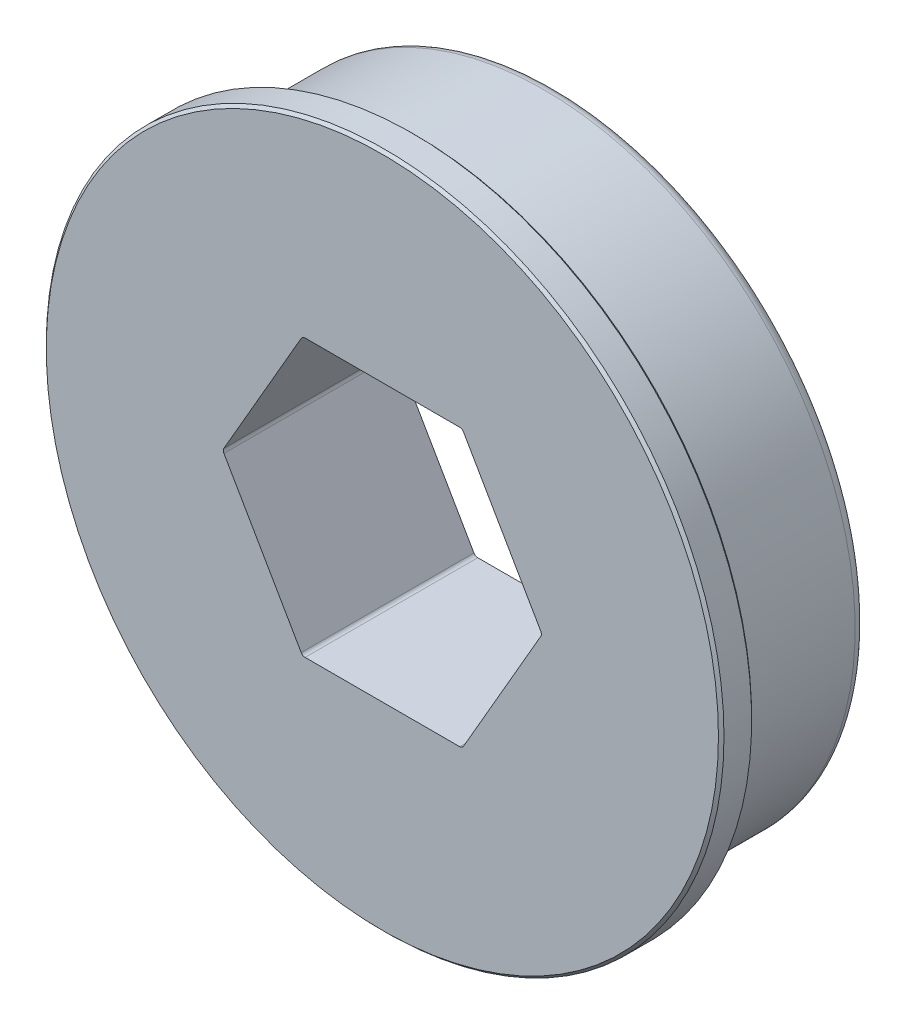
ISO-10303-21;
HEADER;
FILE_DESCRIPTION(('STEP AP214'),'2;1');
FILE_NAME('part.step','',(''),(''),'','','');
FILE_SCHEMA(('AUTOMOTIVE_DESIGN { 1 0 10303 214 1 1 1 1 }'));
ENDSEC;
DATA;
#1=APPLICATION_CONTEXT('core data for automotive mechanical design processes');
#2=APPLICATION_PROTOCOL_DEFINITION('international standard','automotive_design',2000,#1);
#3=PRODUCT_CONTEXT('',#1,'mechanical');
#4=PRODUCT('Part','Part','',(#3));
#5=PRODUCT_RELATED_PRODUCT_CATEGORY('part','',(#4));
#6=PRODUCT_DEFINITION_FORMATION('','',#4);
#7=PRODUCT_DEFINITION_CONTEXT('part definition',#1,'design');
#8=PRODUCT_DEFINITION('design','',#6,#7);
#9=PRODUCT_DEFINITION_SHAPE('','',#8);
#10=(LENGTH_UNIT() NAMED_UNIT(*) SI_UNIT(.MILLI.,.METRE.));
#11=(NAMED_UNIT(*) PLANE_ANGLE_UNIT() SI_UNIT($,.RADIAN.));
#12=(NAMED_UNIT(*) SI_UNIT($,.STERADIAN.) SOLID_ANGLE_UNIT());
#13=UNCERTAINTY_MEASURE_WITH_UNIT(LENGTH_MEASURE(1.E-05),#10,'distance_accuracy_value','');
#14=(GEOMETRIC_REPRESENTATION_CONTEXT(3) GLOBAL_UNCERTAINTY_ASSIGNED_CONTEXT((#13)) GLOBAL_UNIT_ASSIGNED_CONTEXT((#10,
#11,#12)) REPRESENTATION_CONTEXT('',''));
#15=CARTESIAN_POINT('',(0.,0.,0.));
#16=DIRECTION('',(0.,0.,1.));
#17=DIRECTION('',(1.,0.,0.));
#18=AXIS2_PLACEMENT_3D('',#15,#16,#17);
#19=CARTESIAN_POINT('',(0.,0.,7.92734));
#20=DIRECTION('',(0.,0.,-1.));
#21=DIRECTION('',(-1.,0.,0.));
#22=AXIS2_PLACEMENT_3D('',#19,#20,#21);
#23=CYLINDRICAL_SURFACE('',#22,15.5575);
#24=CARTESIAN_POINT('',(0.,0.,7.80034));
#25=DIRECTION('',(0.,0.,1.));
#26=DIRECTION('',(1.,0.,0.));
#27=AXIS2_PLACEMENT_3D('',#24,#25,#26);
#28=CIRCLE('',#27,15.5575);
#29=CARTESIAN_POINT('',(15.5575,0.,7.80034));
#30=VERTEX_POINT('',#29);
#31=EDGE_CURVE('E184',#30,#30,#28,.F.);
#32=ORIENTED_EDGE('',*,*,#31,.T.);
#33=EDGE_LOOP('',(#32));
#34=FACE_BOUND('',#33,.T.);
#35=CARTESIAN_POINT('',(0.,0.,6.53034000000001));
#36=DIRECTION('',(0.,0.,-1.));
#37=DIRECTION('',(-1.,0.,0.));
#38=AXIS2_PLACEMENT_3D('',#35,#36,#37);
#39=CIRCLE('',#38,15.5575);
#40=CARTESIAN_POINT('',(-15.5575,0.,6.53034000000001));
#41=VERTEX_POINT('',#40);
#42=EDGE_CURVE('E181',#41,#41,#39,.F.);
#43=ORIENTED_EDGE('',*,*,#42,.T.);
#44=EDGE_LOOP('',(#43));
#45=FACE_BOUND('',#44,.T.);
#46=ADVANCED_FACE('F34',(#34,#45),#23,.T.);
#47=CARTESIAN_POINT('',(15.5575,0.,7.92734));
#48=DIRECTION('',(0.,0.,1.));
#49=DIRECTION('',(1.,0.,0.));
#50=AXIS2_PLACEMENT_3D('',#47,#48,#49);
#51=PLANE('',#50);
#52=CARTESIAN_POINT('',(0.,0.,7.92734));
#53=DIRECTION('',(0.,0.,1.));
#54=DIRECTION('',(1.,0.,0.));
#55=AXIS2_PLACEMENT_3D('',#52,#53,#54);
#56=CIRCLE('',#55,15.4305);
#57=CARTESIAN_POINT('',(15.4305,0.,7.92734));
#58=VERTEX_POINT('',#57);
#59=EDGE_CURVE('E187',#58,#58,#56,.T.);
#60=ORIENTED_EDGE('',*,*,#59,.T.);
#61=EDGE_LOOP('',(#60));
#62=FACE_BOUND('',#61,.T.);
#63=DIRECTION('',(-0.5,0.866025403784438,0.));
#64=VECTOR('',#63,1.);
#65=CARTESIAN_POINT('',(-3.66617420935411,-6.35000000000001,7.92734));
#66=LINE('',#65,#64);
#67=CARTESIAN_POINT('',(-3.72483299670378,-6.24840000000001,7.92734));
#68=VERTEX_POINT('',#67);
#69=CARTESIAN_POINT('',(-7.27368963135857,-0.101600000000006,7.92734));
#70=VERTEX_POINT('',#69);
#71=EDGE_CURVE('E172',#68,#70,#66,.T.);
#72=ORIENTED_EDGE('',*,*,#71,.T.);
#73=CARTESIAN_POINT('',(-7.09771326930958,0.,7.92734));
#74=DIRECTION('',(0.,0.,1.));
#75=DIRECTION('',(1.,0.,0.));
#76=AXIS2_PLACEMENT_3D('',#73,#74,#75);
#77=CIRCLE('',#76,0.2032);
#78=CARTESIAN_POINT('',(-7.27368963135857,0.101599999999993,7.92734));
#79=VERTEX_POINT('',#78);
#80=EDGE_CURVE('E56',#70,#79,#77,.F.);
#81=ORIENTED_EDGE('',*,*,#80,.T.);
#82=DIRECTION('',(0.5,0.866025403784439,0.));
#83=VECTOR('',#82,1.);
#84=CARTESIAN_POINT('',(-7.33234841870824,0.,7.92734));
#85=LINE('',#84,#83);
#86=CARTESIAN_POINT('',(-3.72483299670379,6.24839999999999,7.92734));
#87=VERTEX_POINT('',#86);
#88=EDGE_CURVE('E167',#79,#87,#85,.T.);
#89=ORIENTED_EDGE('',*,*,#88,.T.);
#90=CARTESIAN_POINT('',(-3.54885663465479,6.14679999999999,7.92734));
#91=DIRECTION('',(0.,0.,1.));
#92=DIRECTION('',(1.,0.,0.));
#93=AXIS2_PLACEMENT_3D('',#90,#91,#92);
#94=CIRCLE('',#93,0.2032);
#95=CARTESIAN_POINT('',(-3.54885663465479,6.34999999999999,7.92734));
#96=VERTEX_POINT('',#95);
#97=EDGE_CURVE('E11',#87,#96,#94,.F.);
#98=ORIENTED_EDGE('',*,*,#97,.T.);
#99=DIRECTION('',(1.,0.,0.));
#100=VECTOR('',#99,1.);
#101=CARTESIAN_POINT('',(-3.66617420935412,6.34999999999999,7.92734));
#102=LINE('',#101,#100);
#103=CARTESIAN_POINT('',(3.5488566346548,6.35,7.92734));
#104=VERTEX_POINT('',#103);
#105=EDGE_CURVE('E240',#96,#104,#102,.T.);
#106=ORIENTED_EDGE('',*,*,#105,.T.);
#107=CARTESIAN_POINT('',(3.5488566346548,6.1468,7.92734));
#108=DIRECTION('',(0.,0.,1.));
#109=DIRECTION('',(1.,0.,0.));
#110=AXIS2_PLACEMENT_3D('',#107,#108,#109);
#111=CIRCLE('',#110,0.2032);
#112=CARTESIAN_POINT('',(3.72483299670379,6.2484,7.92734));
#113=VERTEX_POINT('',#112);
#114=EDGE_CURVE('E134',#104,#113,#111,.F.);
#115=ORIENTED_EDGE('',*,*,#114,.T.);
#116=DIRECTION('',(0.5,-0.866025403784438,0.));
#117=VECTOR('',#116,1.);
#118=CARTESIAN_POINT('',(3.66617420935413,6.35,7.92734));
#119=LINE('',#118,#117);
#120=CARTESIAN_POINT('',(7.27368963135859,0.101599999999997,7.92734));
#121=VERTEX_POINT('',#120);
#122=EDGE_CURVE('E144',#113,#121,#119,.T.);
#123=ORIENTED_EDGE('',*,*,#122,.T.);
#124=CARTESIAN_POINT('',(7.09771326930959,0.,7.92734));
#125=DIRECTION('',(0.,0.,1.));
#126=DIRECTION('',(1.,0.,0.));
#127=AXIS2_PLACEMENT_3D('',#124,#125,#126);
#128=CIRCLE('',#127,0.2032);
#129=CARTESIAN_POINT('',(7.27368963135859,-0.101600000000005,7.92734));
#130=VERTEX_POINT('',#129);
#131=EDGE_CURVE('E220',#121,#130,#128,.F.);
#132=ORIENTED_EDGE('',*,*,#131,.T.);
#133=DIRECTION('',(-0.5,-0.866025403784439,0.));
#134=VECTOR('',#133,1.);
#135=CARTESIAN_POINT('',(7.33234841870825,0.,7.92734));
#136=LINE('',#135,#134);
#137=CARTESIAN_POINT('',(3.7248329967038,-6.24840000000001,7.92734));
#138=VERTEX_POINT('',#137);
#139=EDGE_CURVE('E244',#130,#138,#136,.T.);
#140=ORIENTED_EDGE('',*,*,#139,.T.);
#141=CARTESIAN_POINT('',(3.5488566346548,-6.14680000000001,7.92734));
#142=DIRECTION('',(0.,0.,1.));
#143=DIRECTION('',(1.,0.,0.));
#144=AXIS2_PLACEMENT_3D('',#141,#142,#143);
#145=CIRCLE('',#144,0.2032);
#146=CARTESIAN_POINT('',(3.5488566346548,-6.35000000000001,7.92734));
#147=VERTEX_POINT('',#146);
#148=EDGE_CURVE('E224',#138,#147,#145,.F.);
#149=ORIENTED_EDGE('',*,*,#148,.T.);
#150=DIRECTION('',(-1.,0.,0.));
#151=VECTOR('',#150,1.);
#152=CARTESIAN_POINT('',(3.66617420935413,-6.35000000000001,7.92734));
#153=LINE('',#152,#151);
#154=CARTESIAN_POINT('',(-3.54885663465478,-6.35000000000001,7.92734));
#155=VERTEX_POINT('',#154);
#156=EDGE_CURVE('E250',#147,#155,#153,.T.);
#157=ORIENTED_EDGE('',*,*,#156,.T.);
#158=CARTESIAN_POINT('',(-3.54885663465478,-6.14680000000001,7.92734));
#159=DIRECTION('',(0.,0.,1.));
#160=DIRECTION('',(1.,0.,0.));
#161=AXIS2_PLACEMENT_3D('',#158,#159,#160);
#162=CIRCLE('',#161,0.2032);
#163=EDGE_CURVE('E228',#155,#68,#162,.F.);
#164=ORIENTED_EDGE('',*,*,#163,.T.);
#165=EDGE_LOOP('',(#72,#81,#89,#98,#106,#115,#123,#132,#140,#149,#157,#164));
#166=FACE_BOUND('',#165,.T.);
#167=ADVANCED_FACE('F239',(#62,#166),#51,.T.);
#168=CARTESIAN_POINT('',(0.,0.,0.));
#169=DIRECTION('',(0.,0.,-1.));
#170=DIRECTION('',(-1.,0.,0.));
#171=AXIS2_PLACEMENT_3D('',#168,#169,#170);
#172=PLANE('',#171);
#173=CARTESIAN_POINT('',(0.,0.,0.));
#174=DIRECTION('',(0.,0.,-1.));
#175=DIRECTION('',(-1.,0.,0.));
#176=AXIS2_PLACEMENT_3D('',#173,#174,#175);
#177=CIRCLE('',#176,13.7795);
#178=CARTESIAN_POINT('',(-13.7795,0.,0.));
#179=VERTEX_POINT('',#178);
#180=EDGE_CURVE('E190',#179,#179,#177,.T.);
#181=ORIENTED_EDGE('',*,*,#180,.T.);
#182=EDGE_LOOP('',(#181));
#183=FACE_BOUND('',#182,.T.);
#184=DIRECTION('',(0.5,0.866025403784439,0.));
#185=VECTOR('',#184,1.);
#186=CARTESIAN_POINT('',(-7.33234841870824,0.,0.));
#187=LINE('',#186,#185);
#188=CARTESIAN_POINT('',(-7.27368963135857,0.101599999999993,0.));
#189=VERTEX_POINT('',#188);
#190=CARTESIAN_POINT('',(-3.72483299670379,6.24839999999999,0.));
#191=VERTEX_POINT('',#190);
#192=EDGE_CURVE('E158',#189,#191,#187,.T.);
#193=ORIENTED_EDGE('',*,*,#192,.F.);
#194=CARTESIAN_POINT('',(-7.09771326930958,0.,0.));
#195=DIRECTION('',(0.,0.,-1.));
#196=DIRECTION('',(-1.,0.,0.));
#197=AXIS2_PLACEMENT_3D('',#194,#195,#196);
#198=CIRCLE('',#197,0.2032);
#199=CARTESIAN_POINT('',(-7.27368963135857,-0.101600000000006,0.));
#200=VERTEX_POINT('',#199);
#201=EDGE_CURVE('E230',#189,#200,#198,.F.);
#202=ORIENTED_EDGE('',*,*,#201,.T.);
#203=DIRECTION('',(-0.5,0.866025403784438,0.));
#204=VECTOR('',#203,1.);
#205=CARTESIAN_POINT('',(-3.66617420935411,-6.35000000000001,0.));
#206=LINE('',#205,#204);
#207=CARTESIAN_POINT('',(-3.72483299670378,-6.24840000000001,0.));
#208=VERTEX_POINT('',#207);
#209=EDGE_CURVE('E164',#208,#200,#206,.T.);
#210=ORIENTED_EDGE('',*,*,#209,.F.);
#211=CARTESIAN_POINT('',(-3.54885663465478,-6.14680000000001,0.));
#212=DIRECTION('',(0.,0.,-1.));
#213=DIRECTION('',(-1.,0.,0.));
#214=AXIS2_PLACEMENT_3D('',#211,#212,#213);
#215=CIRCLE('',#214,0.2032);
#216=CARTESIAN_POINT('',(-3.54885663465478,-6.35000000000001,0.));
#217=VERTEX_POINT('',#216);
#218=EDGE_CURVE('E226',#208,#217,#215,.F.);
#219=ORIENTED_EDGE('',*,*,#218,.T.);
#220=DIRECTION('',(-1.,0.,0.));
#221=VECTOR('',#220,1.);
#222=CARTESIAN_POINT('',(3.66617420935413,-6.35000000000001,0.));
#223=LINE('',#222,#221);
#224=CARTESIAN_POINT('',(3.5488566346548,-6.35000000000001,0.));
#225=VERTEX_POINT('',#224);
#226=EDGE_CURVE('E156',#225,#217,#223,.T.);
#227=ORIENTED_EDGE('',*,*,#226,.F.);
#228=CARTESIAN_POINT('',(3.5488566346548,-6.14680000000001,0.));
#229=DIRECTION('',(0.,0.,-1.));
#230=DIRECTION('',(-1.,0.,0.));
#231=AXIS2_PLACEMENT_3D('',#228,#229,#230);
#232=CIRCLE('',#231,0.2032);
#233=CARTESIAN_POINT('',(3.7248329967038,-6.24840000000001,0.));
#234=VERTEX_POINT('',#233);
#235=EDGE_CURVE('E222',#225,#234,#232,.F.);
#236=ORIENTED_EDGE('',*,*,#235,.T.);
#237=DIRECTION('',(-0.5,-0.866025403784439,0.));
#238=VECTOR('',#237,1.);
#239=CARTESIAN_POINT('',(7.33234841870825,0.,0.));
#240=LINE('',#239,#238);
#241=CARTESIAN_POINT('',(7.27368963135859,-0.101600000000005,0.));
#242=VERTEX_POINT('',#241);
#243=EDGE_CURVE('E152',#242,#234,#240,.T.);
#244=ORIENTED_EDGE('',*,*,#243,.F.);
#245=CARTESIAN_POINT('',(7.09771326930959,0.,0.));
#246=DIRECTION('',(0.,0.,-1.));
#247=DIRECTION('',(-1.,0.,0.));
#248=AXIS2_PLACEMENT_3D('',#245,#246,#247);
#249=CIRCLE('',#248,0.2032);
#250=CARTESIAN_POINT('',(7.27368963135859,0.101599999999997,0.));
#251=VERTEX_POINT('',#250);
#252=EDGE_CURVE('E151',#242,#251,#249,.F.);
#253=ORIENTED_EDGE('',*,*,#252,.T.);
#254=DIRECTION('',(0.5,-0.866025403784438,0.));
#255=VECTOR('',#254,1.);
#256=CARTESIAN_POINT('',(3.66617420935413,6.35,0.));
#257=LINE('',#256,#255);
#258=CARTESIAN_POINT('',(3.72483299670379,6.2484,0.));
#259=VERTEX_POINT('',#258);
#260=EDGE_CURVE('E141',#259,#251,#257,.T.);
#261=ORIENTED_EDGE('',*,*,#260,.F.);
#262=CARTESIAN_POINT('',(3.5488566346548,6.1468,0.));
#263=DIRECTION('',(0.,0.,-1.));
#264=DIRECTION('',(-1.,0.,0.));
#265=AXIS2_PLACEMENT_3D('',#262,#263,#264);
#266=CIRCLE('',#265,0.2032);
#267=CARTESIAN_POINT('',(3.5488566346548,6.35,0.));
#268=VERTEX_POINT('',#267);
#269=EDGE_CURVE('E124',#259,#268,#266,.F.);
#270=ORIENTED_EDGE('',*,*,#269,.T.);
#271=DIRECTION('',(1.,0.,0.));
#272=VECTOR('',#271,1.);
#273=CARTESIAN_POINT('',(-3.66617420935412,6.34999999999999,0.));
#274=LINE('',#273,#272);
#275=CARTESIAN_POINT('',(-3.54885663465479,6.34999999999999,0.));
#276=VERTEX_POINT('',#275);
#277=EDGE_CURVE('E153',#276,#268,#274,.T.);
#278=ORIENTED_EDGE('',*,*,#277,.F.);
#279=CARTESIAN_POINT('',(-3.54885663465479,6.14679999999999,0.));
#280=DIRECTION('',(0.,0.,-1.));
#281=DIRECTION('',(-1.,0.,0.));
#282=AXIS2_PLACEMENT_3D('',#279,#280,#281);
#283=CIRCLE('',#282,0.2032);
#284=EDGE_CURVE('E42',#276,#191,#283,.F.);
#285=ORIENTED_EDGE('',*,*,#284,.T.);
#286=EDGE_LOOP('',(#193,#202,#210,#219,#227,#236,#244,#253,#261,#270,#278,#285));
#287=FACE_BOUND('',#286,.T.);
#288=ADVANCED_FACE('F149',(#183,#287),#172,.T.);
#289=CARTESIAN_POINT('',(0.,0.,7.92734));
#290=DIRECTION('',(0.,0.,-1.));
#291=DIRECTION('',(-1.,0.,0.));
#292=AXIS2_PLACEMENT_3D('',#289,#290,#291);
#293=CYLINDRICAL_SURFACE('',#292,14.2875);
#294=CARTESIAN_POINT('',(0.,0.,0.508));
#295=DIRECTION('',(0.,0.,-1.));
#296=DIRECTION('',(-1.,0.,0.));
#297=AXIS2_PLACEMENT_3D('',#294,#295,#296);
#298=CIRCLE('',#297,14.2875);
#299=CARTESIAN_POINT('',(-14.2875,0.,0.508));
#300=VERTEX_POINT('',#299);
#301=EDGE_CURVE('E193',#300,#300,#298,.F.);
#302=ORIENTED_EDGE('',*,*,#301,.T.);
#303=EDGE_LOOP('',(#302));
#304=FACE_BOUND('',#303,.T.);
#305=CARTESIAN_POINT('',(0.,0.,5.89534));
#306=DIRECTION('',(0.,0.,-1.));
#307=DIRECTION('',(-1.,0.,0.));
#308=AXIS2_PLACEMENT_3D('',#305,#306,#307);
#309=CIRCLE('',#308,14.2875);
#310=CARTESIAN_POINT('',(-14.2875,0.,5.89534));
#311=VERTEX_POINT('',#310);
#312=EDGE_CURVE('E175',#311,#311,#309,.T.);
#313=ORIENTED_EDGE('',*,*,#312,.T.);
#314=EDGE_LOOP('',(#313));
#315=FACE_BOUND('',#314,.T.);
#316=ADVANCED_FACE('F318',(#304,#315),#293,.T.);
#317=CARTESIAN_POINT('',(14.2875,0.,5.89534));
#318=DIRECTION('',(0.,0.,1.));
#319=DIRECTION('',(1.,0.,0.));
#320=AXIS2_PLACEMENT_3D('',#317,#318,#319);
#321=PLANE('',#320);
#322=CARTESIAN_POINT('',(0.,0.,5.89534));
#323=DIRECTION('',(0.,0.,-1.));
#324=DIRECTION('',(-1.,0.,0.));
#325=AXIS2_PLACEMENT_3D('',#322,#323,#324);
#326=CIRCLE('',#325,13.97);
#327=CARTESIAN_POINT('',(-13.97,0.,5.89534));
#328=VERTEX_POINT('',#327);
#329=EDGE_CURVE('E171',#328,#328,#326,.T.);
#330=ORIENTED_EDGE('',*,*,#329,.T.);
#331=EDGE_LOOP('',(#330));
#332=FACE_BOUND('',#331,.T.);
#333=ORIENTED_EDGE('',*,*,#312,.F.);
#334=EDGE_LOOP('',(#333));
#335=FACE_BOUND('',#334,.T.);
#336=ADVANCED_FACE('F322',(#332,#335),#321,.T.);
#337=CARTESIAN_POINT('',(0.,0.,7.92734));
#338=DIRECTION('',(0.,0.,-1.));
#339=DIRECTION('',(-1.,0.,0.));
#340=AXIS2_PLACEMENT_3D('',#337,#338,#339);
#341=CYLINDRICAL_SURFACE('',#340,13.97);
#342=CARTESIAN_POINT('',(0.,0.,6.40333999999999));
#343=DIRECTION('',(0.,0.,-1.));
#344=DIRECTION('',(-1.,0.,0.));
#345=AXIS2_PLACEMENT_3D('',#342,#343,#344);
#346=CIRCLE('',#345,13.97);
#347=CARTESIAN_POINT('',(-13.97,0.,6.40333999999999));
#348=VERTEX_POINT('',#347);
#349=EDGE_CURVE('E168',#348,#348,#346,.T.);
#350=ORIENTED_EDGE('',*,*,#349,.T.);
#351=EDGE_LOOP('',(#350));
#352=FACE_BOUND('',#351,.T.);
#353=ORIENTED_EDGE('',*,*,#329,.F.);
#354=EDGE_LOOP('',(#353));
#355=FACE_BOUND('',#354,.T.);
#356=ADVANCED_FACE('F328',(#352,#355),#341,.T.);
#357=CARTESIAN_POINT('',(13.97,0.,6.40334));
#358=DIRECTION('',(0.,0.,-1.));
#359=DIRECTION('',(-1.,0.,0.));
#360=AXIS2_PLACEMENT_3D('',#357,#358,#359);
#361=PLANE('',#360);
#362=CARTESIAN_POINT('',(0.,0.,6.40334));
#363=DIRECTION('',(0.,0.,-1.));
#364=DIRECTION('',(-1.,0.,0.));
#365=AXIS2_PLACEMENT_3D('',#362,#363,#364);
#366=CIRCLE('',#365,15.4305);
#367=CARTESIAN_POINT('',(-15.4305,0.,6.40334));
#368=VERTEX_POINT('',#367);
#369=EDGE_CURVE('E178',#368,#368,#366,.T.);
#370=ORIENTED_EDGE('',*,*,#369,.T.);
#371=EDGE_LOOP('',(#370));
#372=FACE_BOUND('',#371,.T.);
#373=ORIENTED_EDGE('',*,*,#349,.F.);
#374=EDGE_LOOP('',(#373));
#375=FACE_BOUND('',#374,.T.);
#376=ADVANCED_FACE('F332',(#372,#375),#361,.T.);
#377=CARTESIAN_POINT('',(-7.33234841870824,0.,7.92734));
#378=DIRECTION('',(-0.866025403784439,0.5,0.));
#379=DIRECTION('',(-0.5,-0.866025403784439,0.));
#380=AXIS2_PLACEMENT_3D('',#377,#378,#379);
#381=PLANE('',#380);
#382=ORIENTED_EDGE('',*,*,#88,.F.);
#383=DIRECTION('',(0.,0.,-1.));
#384=VECTOR('',#383,1.);
#385=CARTESIAN_POINT('',(-7.27368963135857,0.101599999999994,0.));
#386=LINE('',#385,#384);
#387=EDGE_CURVE('E135',#79,#189,#386,.T.);
#388=ORIENTED_EDGE('',*,*,#387,.T.);
#389=ORIENTED_EDGE('',*,*,#192,.T.);
#390=DIRECTION('',(0.,0.,-1.));
#391=VECTOR('',#390,1.);
#392=CARTESIAN_POINT('',(-3.72483299670378,6.24839999999999,7.92734));
#393=LINE('',#392,#391);
#394=EDGE_CURVE('E49',#191,#87,#393,.F.);
#395=ORIENTED_EDGE('',*,*,#394,.T.);
#396=EDGE_LOOP('',(#382,#388,#389,#395));
#397=FACE_BOUND('',#396,.T.);
#398=ADVANCED_FACE('F234',(#397),#381,.F.);
#399=CARTESIAN_POINT('',(-3.66617420935411,-6.35000000000001,7.92734));
#400=DIRECTION('',(-0.866025403784438,-0.5,0.));
#401=DIRECTION('',(0.5,-0.866025403784439,0.));
#402=AXIS2_PLACEMENT_3D('',#399,#400,#401);
#403=PLANE('',#402);
#404=ORIENTED_EDGE('',*,*,#71,.F.);
#405=DIRECTION('',(0.,0.,-1.));
#406=VECTOR('',#405,1.);
#407=CARTESIAN_POINT('',(-3.72483299670378,-6.24840000000001,0.));
#408=LINE('',#407,#406);
#409=EDGE_CURVE('E212',#68,#208,#408,.T.);
#410=ORIENTED_EDGE('',*,*,#409,.T.);
#411=ORIENTED_EDGE('',*,*,#209,.T.);
#412=DIRECTION('',(0.,0.,-1.));
#413=VECTOR('',#412,1.);
#414=CARTESIAN_POINT('',(-7.27368963135857,-0.101600000000006,7.92734));
#415=LINE('',#414,#413);
#416=EDGE_CURVE('E210',#200,#70,#415,.F.);
#417=ORIENTED_EDGE('',*,*,#416,.T.);
#418=EDGE_LOOP('',(#404,#410,#411,#417));
#419=FACE_BOUND('',#418,.T.);
#420=ADVANCED_FACE('F261',(#419),#403,.F.);
#421=CARTESIAN_POINT('',(3.66617420935413,-6.35000000000001,7.92734));
#422=DIRECTION('',(0.,-1.,0.));
#423=DIRECTION('',(0.,0.,-1.));
#424=AXIS2_PLACEMENT_3D('',#421,#422,#423);
#425=PLANE('',#424);
#426=ORIENTED_EDGE('',*,*,#156,.F.);
#427=DIRECTION('',(0.,0.,-1.));
#428=VECTOR('',#427,1.);
#429=CARTESIAN_POINT('',(3.5488566346548,-6.35000000000001,0.));
#430=LINE('',#429,#428);
#431=EDGE_CURVE('E207',#147,#225,#430,.T.);
#432=ORIENTED_EDGE('',*,*,#431,.T.);
#433=ORIENTED_EDGE('',*,*,#226,.T.);
#434=DIRECTION('',(0.,0.,-1.));
#435=VECTOR('',#434,1.);
#436=CARTESIAN_POINT('',(-3.54885663465478,-6.35000000000001,7.92734));
#437=LINE('',#436,#435);
#438=EDGE_CURVE('E205',#217,#155,#437,.F.);
#439=ORIENTED_EDGE('',*,*,#438,.T.);
#440=EDGE_LOOP('',(#426,#432,#433,#439));
#441=FACE_BOUND('',#440,.T.);
#442=ADVANCED_FACE('F268',(#441),#425,.F.);
#443=CARTESIAN_POINT('',(7.33234841870825,0.,7.92734));
#444=DIRECTION('',(0.866025403784439,-0.5,0.));
#445=DIRECTION('',(0.5,0.866025403784439,0.));
#446=AXIS2_PLACEMENT_3D('',#443,#444,#445);
#447=PLANE('',#446);
#448=ORIENTED_EDGE('',*,*,#139,.F.);
#449=DIRECTION('',(0.,0.,-1.));
#450=VECTOR('',#449,1.);
#451=CARTESIAN_POINT('',(7.27368963135859,-0.101600000000005,0.));
#452=LINE('',#451,#450);
#453=EDGE_CURVE('E202',#130,#242,#452,.T.);
#454=ORIENTED_EDGE('',*,*,#453,.T.);
#455=ORIENTED_EDGE('',*,*,#243,.T.);
#456=DIRECTION('',(0.,0.,-1.));
#457=VECTOR('',#456,1.);
#458=CARTESIAN_POINT('',(3.7248329967038,-6.24840000000001,7.92734));
#459=LINE('',#458,#457);
#460=EDGE_CURVE('E200',#234,#138,#459,.F.);
#461=ORIENTED_EDGE('',*,*,#460,.T.);
#462=EDGE_LOOP('',(#448,#454,#455,#461));
#463=FACE_BOUND('',#462,.T.);
#464=ADVANCED_FACE('F276',(#463),#447,.F.);
#465=CARTESIAN_POINT('',(3.66617420935413,6.35,7.92734));
#466=DIRECTION('',(0.866025403784439,0.5,0.));
#467=DIRECTION('',(-0.5,0.866025403784439,0.));
#468=AXIS2_PLACEMENT_3D('',#465,#466,#467);
#469=PLANE('',#468);
#470=ORIENTED_EDGE('',*,*,#122,.F.);
#471=DIRECTION('',(0.,0.,-1.));
#472=VECTOR('',#471,1.);
#473=CARTESIAN_POINT('',(3.72483299670379,6.2484,0.));
#474=LINE('',#473,#472);
#475=EDGE_CURVE('E128',#113,#259,#474,.T.);
#476=ORIENTED_EDGE('',*,*,#475,.T.);
#477=ORIENTED_EDGE('',*,*,#260,.T.);
#478=DIRECTION('',(0.,0.,-1.));
#479=VECTOR('',#478,1.);
#480=CARTESIAN_POINT('',(7.27368963135859,0.101599999999995,7.92734));
#481=LINE('',#480,#479);
#482=EDGE_CURVE('E146',#251,#121,#481,.F.);
#483=ORIENTED_EDGE('',*,*,#482,.T.);
#484=EDGE_LOOP('',(#470,#476,#477,#483));
#485=FACE_BOUND('',#484,.T.);
#486=ADVANCED_FACE('F140',(#485),#469,.F.);
#487=CARTESIAN_POINT('',(-3.66617420935412,6.34999999999999,7.92734));
#488=DIRECTION('',(0.,1.,0.));
#489=DIRECTION('',(-1.,0.,0.));
#490=AXIS2_PLACEMENT_3D('',#487,#488,#489);
#491=PLANE('',#490);
#492=ORIENTED_EDGE('',*,*,#277,.T.);
#493=DIRECTION('',(0.,0.,-1.));
#494=VECTOR('',#493,1.);
#495=CARTESIAN_POINT('',(3.5488566346548,6.35,7.92734));
#496=LINE('',#495,#494);
#497=EDGE_CURVE('E129',#268,#104,#496,.F.);
#498=ORIENTED_EDGE('',*,*,#497,.T.);
#499=ORIENTED_EDGE('',*,*,#105,.F.);
#500=DIRECTION('',(0.,0.,-1.));
#501=VECTOR('',#500,1.);
#502=CARTESIAN_POINT('',(-3.54885663465479,6.34999999999999,0.));
#503=LINE('',#502,#501);
#504=EDGE_CURVE('E145',#96,#276,#503,.T.);
#505=ORIENTED_EDGE('',*,*,#504,.T.);
#506=EDGE_LOOP('',(#492,#498,#499,#505));
#507=FACE_BOUND('',#506,.T.);
#508=ADVANCED_FACE('F242',(#507),#491,.F.);
#509=CARTESIAN_POINT('',(0.,0.,6.40334));
#510=DIRECTION('',(0.,0.,1.));
#511=DIRECTION('',(1.,0.,0.));
#512=AXIS2_PLACEMENT_3D('',#509,#510,#511);
#513=CONICAL_SURFACE('',#512,15.4305,0.785398163397469);
#514=ORIENTED_EDGE('',*,*,#42,.F.);
#515=EDGE_LOOP('',(#514));
#516=FACE_BOUND('',#515,.T.);
#517=ORIENTED_EDGE('',*,*,#369,.F.);
#518=EDGE_LOOP('',(#517));
#519=FACE_BOUND('',#518,.T.);
#520=ADVANCED_FACE('F301',(#516,#519),#513,.T.);
#521=CARTESIAN_POINT('',(0.,0.,7.80034));
#522=DIRECTION('',(0.,0.,-1.));
#523=DIRECTION('',(-1.,0.,0.));
#524=AXIS2_PLACEMENT_3D('',#521,#522,#523);
#525=CONICAL_SURFACE('',#524,15.5575,0.785398163397442);
#526=ORIENTED_EDGE('',*,*,#59,.F.);
#527=EDGE_LOOP('',(#526));
#528=FACE_BOUND('',#527,.T.);
#529=ORIENTED_EDGE('',*,*,#31,.F.);
#530=EDGE_LOOP('',(#529));
#531=FACE_BOUND('',#530,.T.);
#532=ADVANCED_FACE('F304',(#528,#531),#525,.T.);
#533=CARTESIAN_POINT('',(0.,0.,0.508));
#534=DIRECTION('',(0.,0.,-1.));
#535=DIRECTION('',(-1.,0.,0.));
#536=AXIS2_PLACEMENT_3D('',#533,#534,#535);
#537=TOROIDAL_SURFACE('',#536,13.7795,0.508);
#538=ORIENTED_EDGE('',*,*,#301,.F.);
#539=EDGE_LOOP('',(#538));
#540=FACE_BOUND('',#539,.T.);
#541=ORIENTED_EDGE('',*,*,#180,.F.);
#542=EDGE_LOOP('',(#541));
#543=FACE_BOUND('',#542,.T.);
#544=ADVANCED_FACE('F288',(#540,#543),#537,.T.);
#545=CARTESIAN_POINT('',(3.5488566346548,6.1468,7.92734));
#546=DIRECTION('',(0.,0.,1.));
#547=DIRECTION('',(1.,0.,0.));
#548=AXIS2_PLACEMENT_3D('',#545,#546,#547);
#549=CYLINDRICAL_SURFACE('',#548,0.2032);
#550=ORIENTED_EDGE('',*,*,#114,.F.);
#551=ORIENTED_EDGE('',*,*,#497,.F.);
#552=ORIENTED_EDGE('',*,*,#269,.F.);
#553=ORIENTED_EDGE('',*,*,#475,.F.);
#554=EDGE_LOOP('',(#550,#551,#552,#553));
#555=FACE_BOUND('',#554,.T.);
#556=ADVANCED_FACE('F127',(#555),#549,.F.);
#557=CARTESIAN_POINT('',(7.09771326930959,0.,7.92734));
#558=DIRECTION('',(0.,0.,1.));
#559=DIRECTION('',(1.,0.,0.));
#560=AXIS2_PLACEMENT_3D('',#557,#558,#559);
#561=CYLINDRICAL_SURFACE('',#560,0.2032);
#562=ORIENTED_EDGE('',*,*,#131,.F.);
#563=ORIENTED_EDGE('',*,*,#482,.F.);
#564=ORIENTED_EDGE('',*,*,#252,.F.);
#565=ORIENTED_EDGE('',*,*,#453,.F.);
#566=EDGE_LOOP('',(#562,#563,#564,#565));
#567=FACE_BOUND('',#566,.T.);
#568=ADVANCED_FACE('F280',(#567),#561,.F.);
#569=CARTESIAN_POINT('',(3.5488566346548,-6.14680000000001,7.92734));
#570=DIRECTION('',(0.,0.,1.));
#571=DIRECTION('',(1.,0.,0.));
#572=AXIS2_PLACEMENT_3D('',#569,#570,#571);
#573=CYLINDRICAL_SURFACE('',#572,0.2032);
#574=ORIENTED_EDGE('',*,*,#148,.F.);
#575=ORIENTED_EDGE('',*,*,#460,.F.);
#576=ORIENTED_EDGE('',*,*,#235,.F.);
#577=ORIENTED_EDGE('',*,*,#431,.F.);
#578=EDGE_LOOP('',(#574,#575,#576,#577));
#579=FACE_BOUND('',#578,.T.);
#580=ADVANCED_FACE('F272',(#579),#573,.F.);
#581=CARTESIAN_POINT('',(-3.54885663465478,-6.14680000000001,7.92734));
#582=DIRECTION('',(0.,0.,1.));
#583=DIRECTION('',(1.,0.,0.));
#584=AXIS2_PLACEMENT_3D('',#581,#582,#583);
#585=CYLINDRICAL_SURFACE('',#584,0.2032);
#586=ORIENTED_EDGE('',*,*,#163,.F.);
#587=ORIENTED_EDGE('',*,*,#438,.F.);
#588=ORIENTED_EDGE('',*,*,#218,.F.);
#589=ORIENTED_EDGE('',*,*,#409,.F.);
#590=EDGE_LOOP('',(#586,#587,#588,#589));
#591=FACE_BOUND('',#590,.T.);
#592=ADVANCED_FACE('F263',(#591),#585,.F.);
#593=CARTESIAN_POINT('',(-7.09771326930958,0.,7.92734));
#594=DIRECTION('',(0.,0.,1.));
#595=DIRECTION('',(1.,0.,0.));
#596=AXIS2_PLACEMENT_3D('',#593,#594,#595);
#597=CYLINDRICAL_SURFACE('',#596,0.2032);
#598=ORIENTED_EDGE('',*,*,#80,.F.);
#599=ORIENTED_EDGE('',*,*,#416,.F.);
#600=ORIENTED_EDGE('',*,*,#201,.F.);
#601=ORIENTED_EDGE('',*,*,#387,.F.);
#602=EDGE_LOOP('',(#598,#599,#600,#601));
#603=FACE_BOUND('',#602,.T.);
#604=ADVANCED_FACE('F259',(#603),#597,.F.);
#605=CARTESIAN_POINT('',(-3.54885663465479,6.14679999999999,7.92734));
#606=DIRECTION('',(0.,0.,1.));
#607=DIRECTION('',(1.,0.,0.));
#608=AXIS2_PLACEMENT_3D('',#605,#606,#607);
#609=CYLINDRICAL_SURFACE('',#608,0.2032);
#610=ORIENTED_EDGE('',*,*,#97,.F.);
#611=ORIENTED_EDGE('',*,*,#394,.F.);
#612=ORIENTED_EDGE('',*,*,#284,.F.);
#613=ORIENTED_EDGE('',*,*,#504,.F.);
#614=EDGE_LOOP('',(#610,#611,#612,#613));
#615=FACE_BOUND('',#614,.T.);
#616=ADVANCED_FACE('F36',(#615),#609,.F.);
#617=CLOSED_SHELL('',(#46,#167,#288,#316,#336,#356,#376,#398,#420,#442,#464,#486,#508,#520,#532,
#544,#556,#568,#580,#592,#604,#616));
#618=MANIFOLD_SOLID_BREP('B2',#617);
#619=ADVANCED_BREP_SHAPE_REPRESENTATION('',(#18,#618),#14);
#620=SHAPE_DEFINITION_REPRESENTATION(#9,#619);
ENDSEC;
END-ISO-10303-21;
